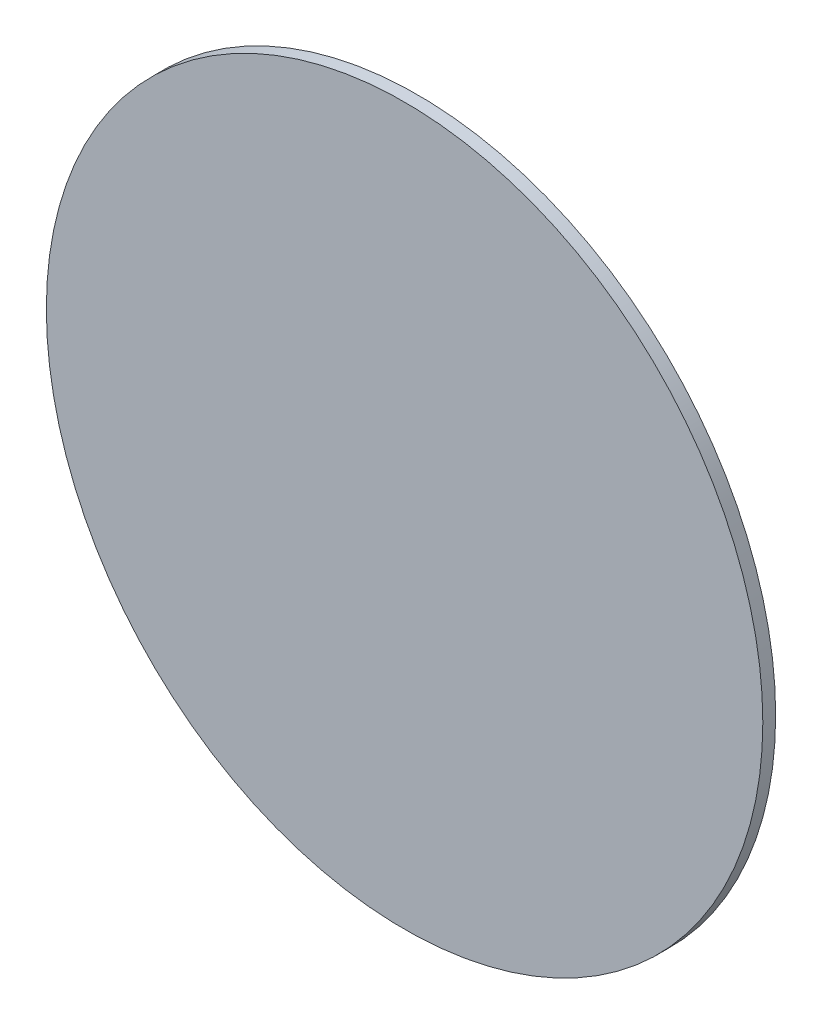
ISO-10303-21;
HEADER;
FILE_DESCRIPTION(('STEP AP214'),'2;1');
FILE_NAME('part.step','',(''),(''),'','','');
FILE_SCHEMA(('AUTOMOTIVE_DESIGN { 1 0 10303 214 1 1 1 1 }'));
ENDSEC;
DATA;
#1=APPLICATION_CONTEXT('core data for automotive mechanical design processes');
#2=APPLICATION_PROTOCOL_DEFINITION('international standard','automotive_design',2000,#1);
#3=PRODUCT_CONTEXT('',#1,'mechanical');
#4=PRODUCT('Part','Part','',(#3));
#5=PRODUCT_RELATED_PRODUCT_CATEGORY('part','',(#4));
#6=PRODUCT_DEFINITION_FORMATION('','',#4);
#7=PRODUCT_DEFINITION_CONTEXT('part definition',#1,'design');
#8=PRODUCT_DEFINITION('design','',#6,#7);
#9=PRODUCT_DEFINITION_SHAPE('','',#8);
#10=(LENGTH_UNIT() NAMED_UNIT(*) SI_UNIT(.MILLI.,.METRE.));
#11=(NAMED_UNIT(*) PLANE_ANGLE_UNIT() SI_UNIT($,.RADIAN.));
#12=(NAMED_UNIT(*) SI_UNIT($,.STERADIAN.) SOLID_ANGLE_UNIT());
#13=UNCERTAINTY_MEASURE_WITH_UNIT(LENGTH_MEASURE(1.E-05),#10,'distance_accuracy_value','');
#14=(GEOMETRIC_REPRESENTATION_CONTEXT(3) GLOBAL_UNCERTAINTY_ASSIGNED_CONTEXT((#13)) GLOBAL_UNIT_ASSIGNED_CONTEXT((#10,
#11,#12)) REPRESENTATION_CONTEXT('',''));
#15=CARTESIAN_POINT('',(0.,0.,0.));
#16=DIRECTION('',(0.,0.,1.));
#17=DIRECTION('',(1.,0.,0.));
#18=AXIS2_PLACEMENT_3D('',#15,#16,#17);
#19=CARTESIAN_POINT('',(-10678.6301042931,9168.81130195226,10.));
#20=DIRECTION('',(0.,0.,-1.));
#21=DIRECTION('',(-1.,0.,0.));
#22=AXIS2_PLACEMENT_3D('',#19,#20,#21);
#23=CYLINDRICAL_SURFACE('',#22,278.896456497368);
#24=CARTESIAN_POINT('',(-10678.6301042931,9168.81130195226,10.));
#25=DIRECTION('',(0.,0.,1.));
#26=DIRECTION('',(1.,0.,0.));
#27=AXIS2_PLACEMENT_3D('',#24,#25,#26);
#28=CIRCLE('',#27,278.896456497368);
#29=CARTESIAN_POINT('',(-10399.7336477957,9168.81130195226,10.));
#30=VERTEX_POINT('',#29);
#31=EDGE_CURVE('E10',#30,#30,#28,.T.);
#32=ORIENTED_EDGE('',*,*,#31,.F.);
#33=EDGE_LOOP('',(#32));
#34=FACE_BOUND('',#33,.T.);
#35=CARTESIAN_POINT('',(-10678.6301042931,9168.81130195226,0.));
#36=DIRECTION('',(0.,0.,1.));
#37=DIRECTION('',(1.,0.,0.));
#38=AXIS2_PLACEMENT_3D('',#35,#36,#37);
#39=CIRCLE('',#38,278.896456497368);
#40=CARTESIAN_POINT('',(-10399.7336477957,9168.81130195226,0.));
#41=VERTEX_POINT('',#40);
#42=EDGE_CURVE('E33',#41,#41,#39,.T.);
#43=ORIENTED_EDGE('',*,*,#42,.T.);
#44=EDGE_LOOP('',(#43));
#45=FACE_BOUND('',#44,.T.);
#46=ADVANCED_FACE('F30',(#34,#45),#23,.T.);
#47=CARTESIAN_POINT('',(-10678.6301042931,9168.81130195226,10.));
#48=DIRECTION('',(0.,0.,1.));
#49=DIRECTION('',(1.,0.,0.));
#50=AXIS2_PLACEMENT_3D('',#47,#48,#49);
#51=PLANE('',#50);
#52=ORIENTED_EDGE('',*,*,#31,.T.);
#53=EDGE_LOOP('',(#52));
#54=FACE_BOUND('',#53,.T.);
#55=ADVANCED_FACE('F45',(#54),#51,.T.);
#56=CARTESIAN_POINT('',(-10678.6301042931,9168.81130195226,0.));
#57=DIRECTION('',(0.,0.,1.));
#58=DIRECTION('',(1.,0.,0.));
#59=AXIS2_PLACEMENT_3D('',#56,#57,#58);
#60=PLANE('',#59);
#61=ORIENTED_EDGE('',*,*,#42,.F.);
#62=EDGE_LOOP('',(#61));
#63=FACE_BOUND('',#62,.T.);
#64=ADVANCED_FACE('F43',(#63),#60,.F.);
#65=CLOSED_SHELL('',(#46,#55,#64));
#66=MANIFOLD_SOLID_BREP('B2',#65);
#67=ADVANCED_BREP_SHAPE_REPRESENTATION('',(#18,#66),#14);
#68=SHAPE_DEFINITION_REPRESENTATION(#9,#67);
ENDSEC;
END-ISO-10303-21;
